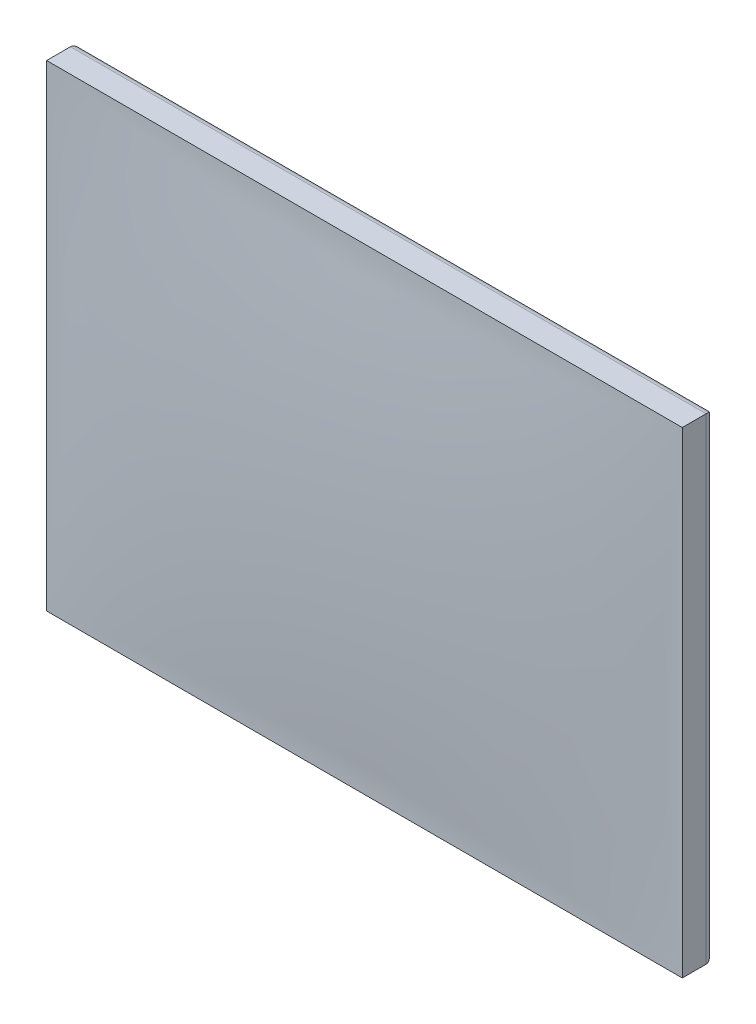
ISO-10303-21;
HEADER;
FILE_DESCRIPTION(('STEP AP214'),'2;1');
FILE_NAME('part.step','',(''),(''),'','','');
FILE_SCHEMA(('AUTOMOTIVE_DESIGN { 1 0 10303 214 1 1 1 1 }'));
ENDSEC;
DATA;
#1=APPLICATION_CONTEXT('core data for automotive mechanical design processes');
#2=APPLICATION_PROTOCOL_DEFINITION('international standard','automotive_design',2000,#1);
#3=PRODUCT_CONTEXT('',#1,'mechanical');
#4=PRODUCT('Part','Part','',(#3));
#5=PRODUCT_RELATED_PRODUCT_CATEGORY('part','',(#4));
#6=PRODUCT_DEFINITION_FORMATION('','',#4);
#7=PRODUCT_DEFINITION_CONTEXT('part definition',#1,'design');
#8=PRODUCT_DEFINITION('design','',#6,#7);
#9=PRODUCT_DEFINITION_SHAPE('','',#8);
#10=(LENGTH_UNIT() NAMED_UNIT(*) SI_UNIT(.MILLI.,.METRE.));
#11=(NAMED_UNIT(*) PLANE_ANGLE_UNIT() SI_UNIT($,.RADIAN.));
#12=(NAMED_UNIT(*) SI_UNIT($,.STERADIAN.) SOLID_ANGLE_UNIT());
#13=UNCERTAINTY_MEASURE_WITH_UNIT(LENGTH_MEASURE(1.E-05),#10,'distance_accuracy_value','');
#14=(GEOMETRIC_REPRESENTATION_CONTEXT(3) GLOBAL_UNCERTAINTY_ASSIGNED_CONTEXT((#13)) GLOBAL_UNIT_ASSIGNED_CONTEXT((#10,
#11,#12)) REPRESENTATION_CONTEXT('',''));
#15=CARTESIAN_POINT('',(0.,0.,0.));
#16=DIRECTION('',(0.,0.,1.));
#17=DIRECTION('',(1.,0.,0.));
#18=AXIS2_PLACEMENT_3D('',#15,#16,#17);
#19=CARTESIAN_POINT('',(-208.758314855876,129.046563192905,20.));
#20=DIRECTION('',(1.,0.,0.));
#21=DIRECTION('',(0.,1.,0.));
#22=AXIS2_PLACEMENT_3D('',#19,#20,#21);
#23=PLANE('',#22);
#24=DIRECTION('',(0.,0.,-1.));
#25=VECTOR('',#24,1.);
#26=CARTESIAN_POINT('',(-208.758314855876,129.046563192905,20.));
#27=LINE('',#26,#25);
#28=CARTESIAN_POINT('',(-208.758314855876,129.046563192905,20.));
#29=VERTEX_POINT('',#28);
#30=CARTESIAN_POINT('',(-208.758314855876,129.046563192905,5.));
#31=VERTEX_POINT('',#30);
#32=EDGE_CURVE('E156',#29,#31,#27,.T.);
#33=ORIENTED_EDGE('',*,*,#32,.T.);
#34=DIRECTION('',(0.,-1.,0.));
#35=VECTOR('',#34,1.);
#36=CARTESIAN_POINT('',(-208.758314855876,129.046563192905,5.));
#37=LINE('',#36,#35);
#38=CARTESIAN_POINT('',(-208.758314855876,-170.953436807095,5.));
#39=VERTEX_POINT('',#38);
#40=EDGE_CURVE('E176',#31,#39,#37,.T.);
#41=ORIENTED_EDGE('',*,*,#40,.T.);
#42=DIRECTION('',(0.,0.,-1.));
#43=VECTOR('',#42,1.);
#44=CARTESIAN_POINT('',(-208.758314855876,-170.953436807095,20.));
#45=LINE('',#44,#43);
#46=CARTESIAN_POINT('',(-208.758314855876,-170.953436807095,20.));
#47=VERTEX_POINT('',#46);
#48=EDGE_CURVE('E166',#47,#39,#45,.T.);
#49=ORIENTED_EDGE('',*,*,#48,.F.);
#50=DIRECTION('',(0.,-1.,0.));
#51=VECTOR('',#50,1.);
#52=CARTESIAN_POINT('',(-208.758314855876,129.046563192905,20.));
#53=LINE('',#52,#51);
#54=EDGE_CURVE('E151',#29,#47,#53,.T.);
#55=ORIENTED_EDGE('',*,*,#54,.F.);
#56=EDGE_LOOP('',(#33,#41,#49,#55));
#57=FACE_BOUND('',#56,.T.);
#58=ADVANCED_FACE('F91',(#57),#23,.F.);
#59=CARTESIAN_POINT('',(-208.758314855876,-170.953436807095,20.));
#60=DIRECTION('',(0.,1.,0.));
#61=DIRECTION('',(-1.,0.,0.));
#62=AXIS2_PLACEMENT_3D('',#59,#60,#61);
#63=PLANE('',#62);
#64=ORIENTED_EDGE('',*,*,#48,.T.);
#65=DIRECTION('',(1.,0.,0.));
#66=VECTOR('',#65,1.);
#67=CARTESIAN_POINT('',(-208.758314855876,-170.953436807095,5.));
#68=LINE('',#67,#66);
#69=CARTESIAN_POINT('',(191.241685144124,-170.953436807095,5.));
#70=VERTEX_POINT('',#69);
#71=EDGE_CURVE('E115',#39,#70,#68,.T.);
#72=ORIENTED_EDGE('',*,*,#71,.T.);
#73=DIRECTION('',(0.,0.,-1.));
#74=VECTOR('',#73,1.);
#75=CARTESIAN_POINT('',(191.241685144124,-170.953436807095,20.));
#76=LINE('',#75,#74);
#77=CARTESIAN_POINT('',(191.241685144124,-170.953436807095,20.));
#78=VERTEX_POINT('',#77);
#79=EDGE_CURVE('E209',#78,#70,#76,.T.);
#80=ORIENTED_EDGE('',*,*,#79,.F.);
#81=DIRECTION('',(1.,0.,0.));
#82=VECTOR('',#81,1.);
#83=CARTESIAN_POINT('',(-208.758314855876,-170.953436807095,20.));
#84=LINE('',#83,#82);
#85=EDGE_CURVE('E167',#47,#78,#84,.T.);
#86=ORIENTED_EDGE('',*,*,#85,.F.);
#87=EDGE_LOOP('',(#64,#72,#80,#86));
#88=FACE_BOUND('',#87,.T.);
#89=ADVANCED_FACE('F208',(#88),#63,.F.);
#90=CARTESIAN_POINT('',(191.241685144124,129.046563192905,20.));
#91=DIRECTION('',(-1.,0.,0.));
#92=DIRECTION('',(0.,0.,1.));
#93=AXIS2_PLACEMENT_3D('',#90,#91,#92);
#94=PLANE('',#93);
#95=ORIENTED_EDGE('',*,*,#79,.T.);
#96=DIRECTION('',(0.,1.,0.));
#97=VECTOR('',#96,1.);
#98=CARTESIAN_POINT('',(191.241685144124,129.046563192905,5.));
#99=LINE('',#98,#97);
#100=CARTESIAN_POINT('',(191.241685144124,129.046563192905,5.));
#101=VERTEX_POINT('',#100);
#102=EDGE_CURVE('E100',#70,#101,#99,.T.);
#103=ORIENTED_EDGE('',*,*,#102,.T.);
#104=DIRECTION('',(0.,0.,-1.));
#105=VECTOR('',#104,1.);
#106=CARTESIAN_POINT('',(191.241685144124,129.046563192905,20.));
#107=LINE('',#106,#105);
#108=CARTESIAN_POINT('',(191.241685144124,129.046563192905,20.));
#109=VERTEX_POINT('',#108);
#110=EDGE_CURVE('E164',#109,#101,#107,.T.);
#111=ORIENTED_EDGE('',*,*,#110,.F.);
#112=DIRECTION('',(0.,1.,0.));
#113=VECTOR('',#112,1.);
#114=CARTESIAN_POINT('',(191.241685144124,129.046563192905,20.));
#115=LINE('',#114,#113);
#116=EDGE_CURVE('E154',#78,#109,#115,.T.);
#117=ORIENTED_EDGE('',*,*,#116,.F.);
#118=EDGE_LOOP('',(#95,#103,#111,#117));
#119=FACE_BOUND('',#118,.T.);
#120=ADVANCED_FACE('F211',(#119),#94,.F.);
#121=CARTESIAN_POINT('',(-208.758314855876,129.046563192905,20.));
#122=DIRECTION('',(0.,-1.,0.));
#123=DIRECTION('',(0.,0.,-1.));
#124=AXIS2_PLACEMENT_3D('',#121,#122,#123);
#125=PLANE('',#124);
#126=ORIENTED_EDGE('',*,*,#110,.T.);
#127=DIRECTION('',(-1.,0.,0.));
#128=VECTOR('',#127,1.);
#129=CARTESIAN_POINT('',(-208.758314855876,129.046563192905,5.));
#130=LINE('',#129,#128);
#131=EDGE_CURVE('E12',#101,#31,#130,.T.);
#132=ORIENTED_EDGE('',*,*,#131,.T.);
#133=ORIENTED_EDGE('',*,*,#32,.F.);
#134=DIRECTION('',(-1.,0.,0.));
#135=VECTOR('',#134,1.);
#136=CARTESIAN_POINT('',(-208.758314855876,129.046563192905,20.));
#137=LINE('',#136,#135);
#138=EDGE_CURVE('E147',#109,#29,#137,.T.);
#139=ORIENTED_EDGE('',*,*,#138,.F.);
#140=EDGE_LOOP('',(#126,#132,#133,#139));
#141=FACE_BOUND('',#140,.T.);
#142=ADVANCED_FACE('F159',(#141),#125,.F.);
#143=CARTESIAN_POINT('',(-208.758314855876,-170.953436807095,20.));
#144=CARTESIAN_POINT('',(-75.4249815225426,-170.953436807095,20.));
#145=CARTESIAN_POINT('',(57.9083518107908,-170.953436807095,20.));
#146=CARTESIAN_POINT('',(191.241685144124,-170.953436807095,20.));
#147=CARTESIAN_POINT('',(-208.758314855876,-70.9534368070954,20.));
#148=CARTESIAN_POINT('',(-75.4249815225426,-70.9534368070953,33.3333333333333));
#149=CARTESIAN_POINT('',(57.9083518107908,-70.9534368070953,33.3333333333333));
#150=CARTESIAN_POINT('',(191.241685144124,-70.9534368070953,20.));
#151=CARTESIAN_POINT('',(-208.758314855876,29.0465631929046,20.));
#152=CARTESIAN_POINT('',(-75.4249815225426,29.0465631929046,33.3333333333333));
#153=CARTESIAN_POINT('',(57.9083518107908,29.0465631929047,33.3333333333333));
#154=CARTESIAN_POINT('',(191.241685144124,29.0465631929047,20.));
#155=CARTESIAN_POINT('',(-208.758314855876,129.046563192905,20.));
#156=CARTESIAN_POINT('',(-75.4249815225426,129.046563192905,20.));
#157=CARTESIAN_POINT('',(57.9083518107908,129.046563192905,20.));
#158=CARTESIAN_POINT('',(191.241685144124,129.046563192905,20.));
#159=B_SPLINE_SURFACE_WITH_KNOTS('',3,3,((#143,#144,#145,#146),(#147,#148,#149,#150),(#151,#152,
#153,#154),(#155,#156,#157,#158)),.UNSPECIFIED.,.F.,.F.,.F.,(4,4),(4,4),(0.,1.),(0.,1.),.UNSPECIFIED.);
#160=ORIENTED_EDGE('',*,*,#54,.T.);
#161=ORIENTED_EDGE('',*,*,#85,.T.);
#162=ORIENTED_EDGE('',*,*,#116,.T.);
#163=ORIENTED_EDGE('',*,*,#138,.T.);
#164=EDGE_LOOP('',(#160,#161,#162,#163));
#165=FACE_BOUND('',#164,.T.);
#166=ADVANCED_FACE('F149',(#165),#159,.F.);
#167=CARTESIAN_POINT('',(0.,0.,0.));
#168=DIRECTION('',(0.,0.,1.));
#169=DIRECTION('',(1.,0.,0.));
#170=AXIS2_PLACEMENT_3D('',#167,#168,#169);
#171=PLANE('',#170);
#172=DIRECTION('',(1.,0.,0.));
#173=VECTOR('',#172,1.);
#174=CARTESIAN_POINT('',(0.,-165.953436807095,0.));
#175=LINE('',#174,#173);
#176=CARTESIAN_POINT('',(186.241685144124,-165.953436807095,0.));
#177=VERTEX_POINT('',#176);
#178=CARTESIAN_POINT('',(-203.758314855876,-165.953436807095,0.));
#179=VERTEX_POINT('',#178);
#180=EDGE_CURVE('E182',#177,#179,#175,.F.);
#181=ORIENTED_EDGE('',*,*,#180,.T.);
#182=DIRECTION('',(0.,-1.,0.));
#183=VECTOR('',#182,1.);
#184=CARTESIAN_POINT('',(-203.758314855876,0.,0.));
#185=LINE('',#184,#183);
#186=CARTESIAN_POINT('',(-203.758314855876,124.046563192905,0.));
#187=VERTEX_POINT('',#186);
#188=EDGE_CURVE('E184',#179,#187,#185,.F.);
#189=ORIENTED_EDGE('',*,*,#188,.T.);
#190=DIRECTION('',(-1.,0.,0.));
#191=VECTOR('',#190,1.);
#192=CARTESIAN_POINT('',(0.,124.046563192905,0.));
#193=LINE('',#192,#191);
#194=CARTESIAN_POINT('',(186.241685144124,124.046563192905,0.));
#195=VERTEX_POINT('',#194);
#196=EDGE_CURVE('E178',#187,#195,#193,.F.);
#197=ORIENTED_EDGE('',*,*,#196,.T.);
#198=DIRECTION('',(0.,1.,0.));
#199=VECTOR('',#198,1.);
#200=CARTESIAN_POINT('',(186.241685144124,0.,0.));
#201=LINE('',#200,#199);
#202=EDGE_CURVE('E180',#195,#177,#201,.F.);
#203=ORIENTED_EDGE('',*,*,#202,.T.);
#204=EDGE_LOOP('',(#181,#189,#197,#203));
#205=FACE_BOUND('',#204,.T.);
#206=ADVANCED_FACE('F229',(#205),#171,.F.);
#207=CARTESIAN_POINT('',(186.241685144124,129.046563192905,5.));
#208=DIRECTION('',(0.,1.,0.));
#209=DIRECTION('',(0.,0.,1.));
#210=AXIS2_PLACEMENT_3D('',#207,#208,#209);
#211=CYLINDRICAL_SURFACE('',#210,5.);
#212=CARTESIAN_POINT('',(186.241685144124,-165.953436807095,5.));
#213=DIRECTION('',(0.707106781186547,0.707106781186547,0.));
#214=DIRECTION('',(-0.707106781186548,0.707106781186547,0.));
#215=AXIS2_PLACEMENT_3D('',#212,#213,#214);
#216=ELLIPSE('',#215,7.07106781186547,5.);
#217=EDGE_CURVE('E171',#177,#70,#216,.F.);
#218=ORIENTED_EDGE('',*,*,#217,.F.);
#219=ORIENTED_EDGE('',*,*,#202,.F.);
#220=CARTESIAN_POINT('',(186.241685144124,124.046563192905,5.));
#221=DIRECTION('',(-0.707106781186547,0.707106781186547,0.));
#222=DIRECTION('',(-0.707106781186547,-0.707106781186547,0.));
#223=AXIS2_PLACEMENT_3D('',#220,#221,#222);
#224=ELLIPSE('',#223,7.07106781186547,5.);
#225=EDGE_CURVE('E95',#101,#195,#224,.T.);
#226=ORIENTED_EDGE('',*,*,#225,.F.);
#227=ORIENTED_EDGE('',*,*,#102,.F.);
#228=EDGE_LOOP('',(#218,#219,#226,#227));
#229=FACE_BOUND('',#228,.T.);
#230=ADVANCED_FACE('F93',(#229),#211,.T.);
#231=CARTESIAN_POINT('',(-208.758314855876,124.046563192905,5.));
#232=DIRECTION('',(-1.,0.,0.));
#233=DIRECTION('',(0.,0.,1.));
#234=AXIS2_PLACEMENT_3D('',#231,#232,#233);
#235=CYLINDRICAL_SURFACE('',#234,5.);
#236=ORIENTED_EDGE('',*,*,#225,.T.);
#237=ORIENTED_EDGE('',*,*,#196,.F.);
#238=CARTESIAN_POINT('',(-203.758314855876,124.046563192905,5.));
#239=DIRECTION('',(-0.707106781186547,-0.707106781186548,0.));
#240=DIRECTION('',(-0.707106781186547,0.707106781186547,0.));
#241=AXIS2_PLACEMENT_3D('',#238,#239,#240);
#242=ELLIPSE('',#241,7.07106781186548,5.);
#243=EDGE_CURVE('E191',#31,#187,#242,.T.);
#244=ORIENTED_EDGE('',*,*,#243,.F.);
#245=ORIENTED_EDGE('',*,*,#131,.F.);
#246=EDGE_LOOP('',(#236,#237,#244,#245));
#247=FACE_BOUND('',#246,.T.);
#248=ADVANCED_FACE('F203',(#247),#235,.T.);
#249=CARTESIAN_POINT('',(-208.758314855876,-165.953436807095,5.));
#250=DIRECTION('',(1.,0.,0.));
#251=DIRECTION('',(0.,1.,0.));
#252=AXIS2_PLACEMENT_3D('',#249,#250,#251);
#253=CYLINDRICAL_SURFACE('',#252,5.);
#254=ORIENTED_EDGE('',*,*,#217,.T.);
#255=ORIENTED_EDGE('',*,*,#71,.F.);
#256=CARTESIAN_POINT('',(-203.758314855876,-165.953436807095,5.));
#257=DIRECTION('',(0.707106781186548,-0.707106781186547,0.));
#258=DIRECTION('',(0.707106781186547,0.707106781186548,0.));
#259=AXIS2_PLACEMENT_3D('',#256,#257,#258);
#260=ELLIPSE('',#259,7.07106781186547,5.);
#261=EDGE_CURVE('E189',#179,#39,#260,.F.);
#262=ORIENTED_EDGE('',*,*,#261,.F.);
#263=ORIENTED_EDGE('',*,*,#180,.F.);
#264=EDGE_LOOP('',(#254,#255,#262,#263));
#265=FACE_BOUND('',#264,.T.);
#266=ADVANCED_FACE('F196',(#265),#253,.T.);
#267=CARTESIAN_POINT('',(-203.758314855876,129.046563192905,5.));
#268=DIRECTION('',(0.,-1.,0.));
#269=DIRECTION('',(1.,0.,0.));
#270=AXIS2_PLACEMENT_3D('',#267,#268,#269);
#271=CYLINDRICAL_SURFACE('',#270,5.);
#272=ORIENTED_EDGE('',*,*,#243,.T.);
#273=ORIENTED_EDGE('',*,*,#188,.F.);
#274=ORIENTED_EDGE('',*,*,#261,.T.);
#275=ORIENTED_EDGE('',*,*,#40,.F.);
#276=EDGE_LOOP('',(#272,#273,#274,#275));
#277=FACE_BOUND('',#276,.T.);
#278=ADVANCED_FACE('F207',(#277),#271,.T.);
#279=CLOSED_SHELL('',(#58,#89,#120,#142,#166,#206,#230,#248,#266,#278));
#280=MANIFOLD_SOLID_BREP('B2',#279);
#281=ADVANCED_BREP_SHAPE_REPRESENTATION('',(#18,#280),#14);
#282=SHAPE_DEFINITION_REPRESENTATION(#9,#281);
ENDSEC;
END-ISO-10303-21;
